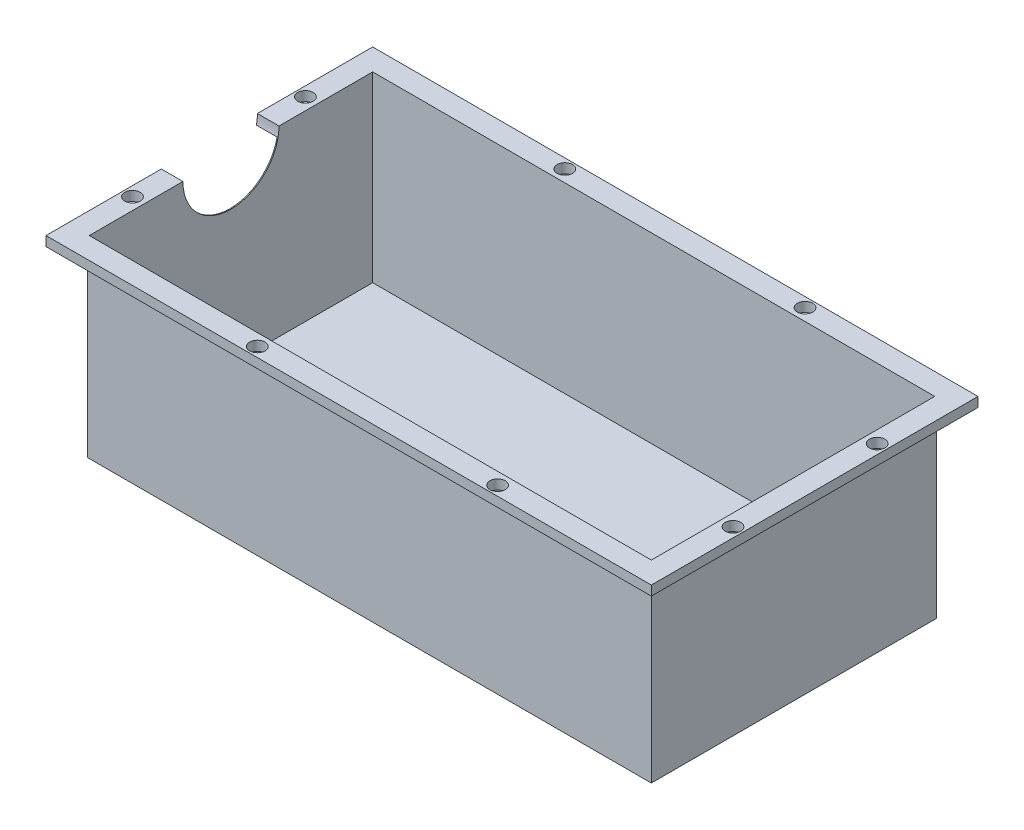
ISO-10303-21;
HEADER;
FILE_DESCRIPTION(('STEP AP214'),'2;1');
FILE_NAME('part.step','',(''),(''),'','','');
FILE_SCHEMA(('AUTOMOTIVE_DESIGN { 1 0 10303 214 1 1 1 1 }'));
ENDSEC;
DATA;
#1=APPLICATION_CONTEXT('core data for automotive mechanical design processes');
#2=APPLICATION_PROTOCOL_DEFINITION('international standard','automotive_design',2000,#1);
#3=PRODUCT_CONTEXT('',#1,'mechanical');
#4=PRODUCT('Part','Part','',(#3));
#5=PRODUCT_RELATED_PRODUCT_CATEGORY('part','',(#4));
#6=PRODUCT_DEFINITION_FORMATION('','',#4);
#7=PRODUCT_DEFINITION_CONTEXT('part definition',#1,'design');
#8=PRODUCT_DEFINITION('design','',#6,#7);
#9=PRODUCT_DEFINITION_SHAPE('','',#8);
#10=(LENGTH_UNIT() NAMED_UNIT(*) SI_UNIT(.MILLI.,.METRE.));
#11=(NAMED_UNIT(*) PLANE_ANGLE_UNIT() SI_UNIT($,.RADIAN.));
#12=(NAMED_UNIT(*) SI_UNIT($,.STERADIAN.) SOLID_ANGLE_UNIT());
#13=UNCERTAINTY_MEASURE_WITH_UNIT(LENGTH_MEASURE(1.E-05),#10,'distance_accuracy_value','');
#14=(GEOMETRIC_REPRESENTATION_CONTEXT(3) GLOBAL_UNCERTAINTY_ASSIGNED_CONTEXT((#13)) GLOBAL_UNIT_ASSIGNED_CONTEXT((#10,
#11,#12)) REPRESENTATION_CONTEXT('',''));
#15=CARTESIAN_POINT('',(0.,0.,0.));
#16=DIRECTION('',(0.,0.,1.));
#17=DIRECTION('',(1.,0.,0.));
#18=AXIS2_PLACEMENT_3D('',#15,#16,#17);
#19=CARTESIAN_POINT('',(-63.,40.,-34.));
#20=DIRECTION('',(1.,0.,0.));
#21=DIRECTION('',(0.,0.,-1.));
#22=AXIS2_PLACEMENT_3D('',#19,#20,#21);
#23=PLANE('',#22);
#24=DIRECTION('',(0.,0.,1.));
#25=VECTOR('',#24,1.);
#26=CARTESIAN_POINT('',(-63.,40.,-34.));
#27=LINE('',#26,#25);
#28=CARTESIAN_POINT('',(-63.,40.,10.));
#29=VERTEX_POINT('',#28);
#30=CARTESIAN_POINT('',(-63.,40.,34.));
#31=VERTEX_POINT('',#30);
#32=EDGE_CURVE('E194',#29,#31,#27,.T.);
#33=ORIENTED_EDGE('',*,*,#32,.F.);
#34=CARTESIAN_POINT('',(-63.,40.,0.));
#35=DIRECTION('',(-1.,0.,0.));
#36=DIRECTION('',(0.,0.,1.));
#37=AXIS2_PLACEMENT_3D('',#34,#35,#36);
#38=CIRCLE('',#37,10.);
#39=CARTESIAN_POINT('',(-63.,38.,9.79795897113272));
#40=VERTEX_POINT('',#39);
#41=EDGE_CURVE('E177',#40,#29,#38,.T.);
#42=ORIENTED_EDGE('',*,*,#41,.F.);
#43=DIRECTION('',(0.,0.,1.));
#44=VECTOR('',#43,1.);
#45=CARTESIAN_POINT('',(-63.,38.,-34.));
#46=LINE('',#45,#44);
#47=CARTESIAN_POINT('',(-63.,38.,34.));
#48=VERTEX_POINT('',#47);
#49=EDGE_CURVE('E306',#40,#48,#46,.T.);
#50=ORIENTED_EDGE('',*,*,#49,.T.);
#51=DIRECTION('',(0.,-1.,0.));
#52=VECTOR('',#51,1.);
#53=CARTESIAN_POINT('',(-63.,40.,34.));
#54=LINE('',#53,#52);
#55=EDGE_CURVE('E203',#31,#48,#54,.T.);
#56=ORIENTED_EDGE('',*,*,#55,.F.);
#57=EDGE_LOOP('',(#33,#42,#50,#56));
#58=FACE_BOUND('',#57,.T.);
#59=ADVANCED_FACE('F63',(#58),#23,.F.);
#60=CARTESIAN_POINT('',(63.,40.,-34.));
#61=DIRECTION('',(-1.,0.,0.));
#62=DIRECTION('',(0.,0.,1.));
#63=AXIS2_PLACEMENT_3D('',#60,#61,#62);
#64=PLANE('',#63);
#65=DIRECTION('',(0.,-1.,0.));
#66=VECTOR('',#65,1.);
#67=CARTESIAN_POINT('',(63.,40.,34.));
#68=LINE('',#67,#66);
#69=CARTESIAN_POINT('',(63.,40.,34.));
#70=VERTEX_POINT('',#69);
#71=CARTESIAN_POINT('',(63.,38.,34.));
#72=VERTEX_POINT('',#71);
#73=EDGE_CURVE('E219',#70,#72,#68,.T.);
#74=ORIENTED_EDGE('',*,*,#73,.T.);
#75=DIRECTION('',(0.,0.,1.));
#76=VECTOR('',#75,1.);
#77=CARTESIAN_POINT('',(63.,38.,-34.));
#78=LINE('',#77,#76);
#79=CARTESIAN_POINT('',(63.,38.,-34.));
#80=VERTEX_POINT('',#79);
#81=EDGE_CURVE('E88',#80,#72,#78,.T.);
#82=ORIENTED_EDGE('',*,*,#81,.F.);
#83=DIRECTION('',(0.,-1.,0.));
#84=VECTOR('',#83,1.);
#85=CARTESIAN_POINT('',(63.,40.,-34.));
#86=LINE('',#85,#84);
#87=CARTESIAN_POINT('',(63.,40.,-34.));
#88=VERTEX_POINT('',#87);
#89=EDGE_CURVE('E73',#88,#80,#86,.T.);
#90=ORIENTED_EDGE('',*,*,#89,.F.);
#91=DIRECTION('',(0.,0.,-1.));
#92=VECTOR('',#91,1.);
#93=CARTESIAN_POINT('',(63.,40.,-34.));
#94=LINE('',#93,#92);
#95=EDGE_CURVE('E213',#70,#88,#94,.T.);
#96=ORIENTED_EDGE('',*,*,#95,.F.);
#97=EDGE_LOOP('',(#74,#82,#90,#96));
#98=FACE_BOUND('',#97,.T.);
#99=ADVANCED_FACE('F65',(#98),#64,.F.);
#100=CARTESIAN_POINT('',(-63.,40.,-34.));
#101=DIRECTION('',(0.,0.,1.));
#102=DIRECTION('',(1.,0.,0.));
#103=AXIS2_PLACEMENT_3D('',#100,#101,#102);
#104=PLANE('',#103);
#105=ORIENTED_EDGE('',*,*,#89,.T.);
#106=DIRECTION('',(-1.,0.,0.));
#107=VECTOR('',#106,1.);
#108=CARTESIAN_POINT('',(63.,38.,-34.));
#109=LINE('',#108,#107);
#110=CARTESIAN_POINT('',(-63.,38.,-34.));
#111=VERTEX_POINT('',#110);
#112=EDGE_CURVE('E305',#80,#111,#109,.T.);
#113=ORIENTED_EDGE('',*,*,#112,.T.);
#114=DIRECTION('',(0.,-1.,0.));
#115=VECTOR('',#114,1.);
#116=CARTESIAN_POINT('',(-63.,40.,-34.));
#117=LINE('',#116,#115);
#118=CARTESIAN_POINT('',(-63.,40.,-34.));
#119=VERTEX_POINT('',#118);
#120=EDGE_CURVE('E225',#119,#111,#117,.T.);
#121=ORIENTED_EDGE('',*,*,#120,.F.);
#122=DIRECTION('',(-1.,0.,0.));
#123=VECTOR('',#122,1.);
#124=CARTESIAN_POINT('',(-63.,40.,-34.));
#125=LINE('',#124,#123);
#126=EDGE_CURVE('E207',#88,#119,#125,.T.);
#127=ORIENTED_EDGE('',*,*,#126,.F.);
#128=EDGE_LOOP('',(#105,#113,#121,#127));
#129=FACE_BOUND('',#128,.T.);
#130=ADVANCED_FACE('F286',(#129),#104,.F.);
#131=CARTESIAN_POINT('',(-63.,38.,-9.79795897113272));
#132=VERTEX_POINT('',#131);
#133=EDGE_CURVE('E300',#111,#132,#46,.T.);
#134=ORIENTED_EDGE('',*,*,#133,.T.);
#135=CARTESIAN_POINT('',(-63.,40.,-10.));
#136=VERTEX_POINT('',#135);
#137=EDGE_CURVE('E188',#136,#132,#38,.T.);
#138=ORIENTED_EDGE('',*,*,#137,.F.);
#139=EDGE_CURVE('E206',#119,#136,#27,.T.);
#140=ORIENTED_EDGE('',*,*,#139,.F.);
#141=ORIENTED_EDGE('',*,*,#120,.T.);
#142=EDGE_LOOP('',(#134,#138,#140,#141));
#143=FACE_BOUND('',#142,.T.);
#144=ADVANCED_FACE('F282',(#143),#23,.F.);
#145=CARTESIAN_POINT('',(-63.,40.,34.));
#146=DIRECTION('',(0.,0.,-1.));
#147=DIRECTION('',(-1.,0.,0.));
#148=AXIS2_PLACEMENT_3D('',#145,#146,#147);
#149=PLANE('',#148);
#150=ORIENTED_EDGE('',*,*,#55,.T.);
#151=DIRECTION('',(-1.,0.,0.));
#152=VECTOR('',#151,1.);
#153=CARTESIAN_POINT('',(63.,38.,34.));
#154=LINE('',#153,#152);
#155=EDGE_CURVE('E311',#72,#48,#154,.T.);
#156=ORIENTED_EDGE('',*,*,#155,.F.);
#157=ORIENTED_EDGE('',*,*,#73,.F.);
#158=DIRECTION('',(1.,0.,0.));
#159=VECTOR('',#158,1.);
#160=CARTESIAN_POINT('',(-63.,40.,34.));
#161=LINE('',#160,#159);
#162=EDGE_CURVE('E212',#31,#70,#161,.T.);
#163=ORIENTED_EDGE('',*,*,#162,.F.);
#164=EDGE_LOOP('',(#150,#156,#157,#163));
#165=FACE_BOUND('',#164,.T.);
#166=ADVANCED_FACE('F290',(#165),#149,.F.);
#167=CARTESIAN_POINT('',(0.,40.,0.));
#168=DIRECTION('',(0.,1.,0.));
#169=DIRECTION('',(0.,0.,1.));
#170=AXIS2_PLACEMENT_3D('',#167,#168,#169);
#171=PLANE('',#170);
#172=CARTESIAN_POINT('',(-61.,40.,18.));
#173=DIRECTION('',(0.,-1.,0.));
#174=DIRECTION('',(0.,0.,-1.));
#175=AXIS2_PLACEMENT_3D('',#172,#173,#174);
#176=CIRCLE('',#175,1.6);
#177=CARTESIAN_POINT('',(-61.,40.,16.4));
#178=VERTEX_POINT('',#177);
#179=EDGE_CURVE('E488',#178,#178,#176,.T.);
#180=ORIENTED_EDGE('',*,*,#179,.T.);
#181=EDGE_LOOP('',(#180));
#182=FACE_BOUND('',#181,.T.);
#183=CARTESIAN_POINT('',(-61.,40.,-18.));
#184=DIRECTION('',(0.,-1.,0.));
#185=DIRECTION('',(0.,0.,1.));
#186=AXIS2_PLACEMENT_3D('',#183,#184,#185);
#187=CIRCLE('',#186,1.6);
#188=CARTESIAN_POINT('',(-61.,40.,-16.4));
#189=VERTEX_POINT('',#188);
#190=EDGE_CURVE('E498',#189,#189,#187,.T.);
#191=ORIENTED_EDGE('',*,*,#190,.T.);
#192=EDGE_LOOP('',(#191));
#193=FACE_BOUND('',#192,.T.);
#194=CARTESIAN_POINT('',(61.,40.,-15.));
#195=DIRECTION('',(0.,-1.,0.));
#196=DIRECTION('',(0.,0.,1.));
#197=AXIS2_PLACEMENT_3D('',#194,#195,#196);
#198=CIRCLE('',#197,1.60000000000001);
#199=CARTESIAN_POINT('',(61.,40.,-13.4));
#200=VERTEX_POINT('',#199);
#201=EDGE_CURVE('E493',#200,#200,#198,.T.);
#202=ORIENTED_EDGE('',*,*,#201,.T.);
#203=EDGE_LOOP('',(#202));
#204=FACE_BOUND('',#203,.T.);
#205=CARTESIAN_POINT('',(-21.,40.,32.));
#206=DIRECTION('',(0.,-1.,0.));
#207=DIRECTION('',(0.,0.,-1.));
#208=AXIS2_PLACEMENT_3D('',#205,#206,#207);
#209=CIRCLE('',#208,1.6);
#210=CARTESIAN_POINT('',(-21.,40.,30.4));
#211=VERTEX_POINT('',#210);
#212=EDGE_CURVE('E489',#211,#211,#209,.T.);
#213=ORIENTED_EDGE('',*,*,#212,.T.);
#214=EDGE_LOOP('',(#213));
#215=FACE_BOUND('',#214,.T.);
#216=CARTESIAN_POINT('',(29.,40.,-32.));
#217=DIRECTION('',(0.,-1.,0.));
#218=DIRECTION('',(0.,0.,1.));
#219=AXIS2_PLACEMENT_3D('',#216,#217,#218);
#220=CIRCLE('',#219,1.6);
#221=CARTESIAN_POINT('',(29.,40.,-30.4));
#222=VERTEX_POINT('',#221);
#223=EDGE_CURVE('E509',#222,#222,#220,.T.);
#224=ORIENTED_EDGE('',*,*,#223,.T.);
#225=EDGE_LOOP('',(#224));
#226=FACE_BOUND('',#225,.T.);
#227=CARTESIAN_POINT('',(-21.,40.,-32.));
#228=DIRECTION('',(0.,-1.,0.));
#229=DIRECTION('',(0.,0.,1.));
#230=AXIS2_PLACEMENT_3D('',#227,#228,#229);
#231=CIRCLE('',#230,1.6);
#232=CARTESIAN_POINT('',(-21.,40.,-30.4));
#233=VERTEX_POINT('',#232);
#234=EDGE_CURVE('E505',#233,#233,#231,.T.);
#235=ORIENTED_EDGE('',*,*,#234,.T.);
#236=EDGE_LOOP('',(#235));
#237=FACE_BOUND('',#236,.T.);
#238=CARTESIAN_POINT('',(29.,40.,32.));
#239=DIRECTION('',(0.,-1.,0.));
#240=DIRECTION('',(0.,0.,-1.));
#241=AXIS2_PLACEMENT_3D('',#238,#239,#240);
#242=CIRCLE('',#241,1.6);
#243=CARTESIAN_POINT('',(29.,40.,30.4));
#244=VERTEX_POINT('',#243);
#245=EDGE_CURVE('E494',#244,#244,#242,.T.);
#246=ORIENTED_EDGE('',*,*,#245,.T.);
#247=EDGE_LOOP('',(#246));
#248=FACE_BOUND('',#247,.T.);
#249=CARTESIAN_POINT('',(61.,40.,15.));
#250=DIRECTION('',(0.,-1.,0.));
#251=DIRECTION('',(0.,0.,-1.));
#252=AXIS2_PLACEMENT_3D('',#249,#250,#251);
#253=CIRCLE('',#252,1.6);
#254=CARTESIAN_POINT('',(61.,40.,13.4));
#255=VERTEX_POINT('',#254);
#256=EDGE_CURVE('E237',#255,#255,#253,.T.);
#257=ORIENTED_EDGE('',*,*,#256,.T.);
#258=EDGE_LOOP('',(#257));
#259=FACE_BOUND('',#258,.T.);
#260=DIRECTION('',(-1.,0.,0.));
#261=VECTOR('',#260,1.);
#262=CARTESIAN_POINT('',(-25.,40.,-10.));
#263=LINE('',#262,#261);
#264=CARTESIAN_POINT('',(-58.5,40.,-10.));
#265=VERTEX_POINT('',#264);
#266=EDGE_CURVE('E199',#265,#136,#263,.T.);
#267=ORIENTED_EDGE('',*,*,#266,.F.);
#268=DIRECTION('',(0.,0.,1.));
#269=VECTOR('',#268,1.);
#270=CARTESIAN_POINT('',(-58.5,40.,-29.5));
#271=LINE('',#270,#269);
#272=CARTESIAN_POINT('',(-58.5,40.,-29.5));
#273=VERTEX_POINT('',#272);
#274=EDGE_CURVE('E323',#273,#265,#271,.T.);
#275=ORIENTED_EDGE('',*,*,#274,.F.);
#276=DIRECTION('',(-1.,0.,0.));
#277=VECTOR('',#276,1.);
#278=CARTESIAN_POINT('',(58.5,40.,-29.5));
#279=LINE('',#278,#277);
#280=CARTESIAN_POINT('',(58.5,40.,-29.5));
#281=VERTEX_POINT('',#280);
#282=EDGE_CURVE('E342',#281,#273,#279,.T.);
#283=ORIENTED_EDGE('',*,*,#282,.F.);
#284=DIRECTION('',(0.,0.,-1.));
#285=VECTOR('',#284,1.);
#286=CARTESIAN_POINT('',(58.5,40.,29.5));
#287=LINE('',#286,#285);
#288=CARTESIAN_POINT('',(58.5,40.,29.5));
#289=VERTEX_POINT('',#288);
#290=EDGE_CURVE('E338',#289,#281,#287,.T.);
#291=ORIENTED_EDGE('',*,*,#290,.F.);
#292=DIRECTION('',(1.,0.,0.));
#293=VECTOR('',#292,1.);
#294=CARTESIAN_POINT('',(-58.5,40.,29.5));
#295=LINE('',#294,#293);
#296=CARTESIAN_POINT('',(-58.5,40.,29.5));
#297=VERTEX_POINT('',#296);
#298=EDGE_CURVE('E317',#297,#289,#295,.T.);
#299=ORIENTED_EDGE('',*,*,#298,.F.);
#300=CARTESIAN_POINT('',(-58.5,40.,10.));
#301=VERTEX_POINT('',#300);
#302=EDGE_CURVE('E197',#301,#297,#271,.T.);
#303=ORIENTED_EDGE('',*,*,#302,.F.);
#304=DIRECTION('',(-1.,0.,0.));
#305=VECTOR('',#304,1.);
#306=CARTESIAN_POINT('',(-25.,40.,10.));
#307=LINE('',#306,#305);
#308=EDGE_CURVE('E180',#29,#301,#307,.F.);
#309=ORIENTED_EDGE('',*,*,#308,.F.);
#310=ORIENTED_EDGE('',*,*,#32,.T.);
#311=ORIENTED_EDGE('',*,*,#162,.T.);
#312=ORIENTED_EDGE('',*,*,#95,.T.);
#313=ORIENTED_EDGE('',*,*,#126,.T.);
#314=ORIENTED_EDGE('',*,*,#139,.T.);
#315=EDGE_LOOP('',(#267,#275,#283,#291,#299,#303,#309,#310,#311,#312,#313,#314));
#316=FACE_BOUND('',#315,.T.);
#317=ADVANCED_FACE('F193',(#182,#193,#204,#215,#226,#237,#248,#259,#316),#171,.T.);
#318=CARTESIAN_POINT('',(-58.5,2.,29.5));
#319=DIRECTION('',(0.,0.,1.));
#320=DIRECTION('',(1.,0.,0.));
#321=AXIS2_PLACEMENT_3D('',#318,#319,#320);
#322=PLANE('',#321);
#323=ORIENTED_EDGE('',*,*,#298,.T.);
#324=DIRECTION('',(0.,1.,0.));
#325=VECTOR('',#324,1.);
#326=CARTESIAN_POINT('',(58.5,2.,29.5));
#327=LINE('',#326,#325);
#328=CARTESIAN_POINT('',(58.5,2.,29.5));
#329=VERTEX_POINT('',#328);
#330=EDGE_CURVE('E335',#329,#289,#327,.T.);
#331=ORIENTED_EDGE('',*,*,#330,.F.);
#332=DIRECTION('',(1.,0.,0.));
#333=VECTOR('',#332,1.);
#334=CARTESIAN_POINT('',(-58.5,2.,29.5));
#335=LINE('',#334,#333);
#336=CARTESIAN_POINT('',(-58.5,2.,29.5));
#337=VERTEX_POINT('',#336);
#338=EDGE_CURVE('E318',#337,#329,#335,.T.);
#339=ORIENTED_EDGE('',*,*,#338,.F.);
#340=DIRECTION('',(0.,1.,0.));
#341=VECTOR('',#340,1.);
#342=CARTESIAN_POINT('',(-58.5,2.,29.5));
#343=LINE('',#342,#341);
#344=EDGE_CURVE('E349',#337,#297,#343,.T.);
#345=ORIENTED_EDGE('',*,*,#344,.T.);
#346=EDGE_LOOP('',(#323,#331,#339,#345));
#347=FACE_BOUND('',#346,.T.);
#348=ADVANCED_FACE('F383',(#347),#322,.F.);
#349=CARTESIAN_POINT('',(-58.5,2.,-29.5));
#350=DIRECTION('',(-1.,0.,0.));
#351=DIRECTION('',(0.,0.,1.));
#352=AXIS2_PLACEMENT_3D('',#349,#350,#351);
#353=PLANE('',#352);
#354=ORIENTED_EDGE('',*,*,#274,.T.);
#355=CARTESIAN_POINT('',(-58.5,40.,0.));
#356=DIRECTION('',(-1.,0.,0.));
#357=DIRECTION('',(0.,0.,1.));
#358=AXIS2_PLACEMENT_3D('',#355,#356,#357);
#359=CIRCLE('',#358,10.);
#360=EDGE_CURVE('E200',#265,#301,#359,.T.);
#361=ORIENTED_EDGE('',*,*,#360,.T.);
#362=ORIENTED_EDGE('',*,*,#302,.T.);
#363=ORIENTED_EDGE('',*,*,#344,.F.);
#364=DIRECTION('',(0.,0.,1.));
#365=VECTOR('',#364,1.);
#366=CARTESIAN_POINT('',(-58.5,2.,-29.5));
#367=LINE('',#366,#365);
#368=CARTESIAN_POINT('',(-58.5,2.,-29.5));
#369=VERTEX_POINT('',#368);
#370=EDGE_CURVE('E331',#369,#337,#367,.T.);
#371=ORIENTED_EDGE('',*,*,#370,.F.);
#372=DIRECTION('',(0.,1.,0.));
#373=VECTOR('',#372,1.);
#374=CARTESIAN_POINT('',(-58.5,2.,-29.5));
#375=LINE('',#374,#373);
#376=EDGE_CURVE('E353',#369,#273,#375,.T.);
#377=ORIENTED_EDGE('',*,*,#376,.T.);
#378=EDGE_LOOP('',(#354,#361,#362,#363,#371,#377));
#379=FACE_BOUND('',#378,.T.);
#380=ADVANCED_FACE('F372',(#379),#353,.F.);
#381=CARTESIAN_POINT('',(58.5,2.,-29.5));
#382=DIRECTION('',(0.,0.,-1.));
#383=DIRECTION('',(-1.,0.,0.));
#384=AXIS2_PLACEMENT_3D('',#381,#382,#383);
#385=PLANE('',#384);
#386=ORIENTED_EDGE('',*,*,#282,.T.);
#387=ORIENTED_EDGE('',*,*,#376,.F.);
#388=DIRECTION('',(-1.,0.,0.));
#389=VECTOR('',#388,1.);
#390=CARTESIAN_POINT('',(58.5,2.,-29.5));
#391=LINE('',#390,#389);
#392=CARTESIAN_POINT('',(58.5,2.,-29.5));
#393=VERTEX_POINT('',#392);
#394=EDGE_CURVE('E327',#393,#369,#391,.T.);
#395=ORIENTED_EDGE('',*,*,#394,.F.);
#396=DIRECTION('',(0.,1.,0.));
#397=VECTOR('',#396,1.);
#398=CARTESIAN_POINT('',(58.5,2.,-29.5));
#399=LINE('',#398,#397);
#400=EDGE_CURVE('E356',#393,#281,#399,.T.);
#401=ORIENTED_EDGE('',*,*,#400,.T.);
#402=EDGE_LOOP('',(#386,#387,#395,#401));
#403=FACE_BOUND('',#402,.T.);
#404=ADVANCED_FACE('F376',(#403),#385,.F.);
#405=CARTESIAN_POINT('',(58.5,2.,29.5));
#406=DIRECTION('',(1.,0.,0.));
#407=DIRECTION('',(0.,0.,-1.));
#408=AXIS2_PLACEMENT_3D('',#405,#406,#407);
#409=PLANE('',#408);
#410=ORIENTED_EDGE('',*,*,#290,.T.);
#411=ORIENTED_EDGE('',*,*,#400,.F.);
#412=DIRECTION('',(0.,0.,-1.));
#413=VECTOR('',#412,1.);
#414=CARTESIAN_POINT('',(58.5,2.,29.5));
#415=LINE('',#414,#413);
#416=EDGE_CURVE('E322',#329,#393,#415,.T.);
#417=ORIENTED_EDGE('',*,*,#416,.F.);
#418=ORIENTED_EDGE('',*,*,#330,.T.);
#419=EDGE_LOOP('',(#410,#411,#417,#418));
#420=FACE_BOUND('',#419,.T.);
#421=ADVANCED_FACE('F379',(#420),#409,.F.);
#422=CARTESIAN_POINT('',(0.,2.,0.));
#423=DIRECTION('',(0.,1.,0.));
#424=DIRECTION('',(0.,0.,1.));
#425=AXIS2_PLACEMENT_3D('',#422,#423,#424);
#426=PLANE('',#425);
#427=ORIENTED_EDGE('',*,*,#338,.T.);
#428=ORIENTED_EDGE('',*,*,#416,.T.);
#429=ORIENTED_EDGE('',*,*,#394,.T.);
#430=ORIENTED_EDGE('',*,*,#370,.T.);
#431=EDGE_LOOP('',(#427,#428,#429,#430));
#432=FACE_BOUND('',#431,.T.);
#433=ADVANCED_FACE('F386',(#432),#426,.T.);
#434=CARTESIAN_POINT('',(0.,38.,0.));
#435=DIRECTION('',(0.,1.,0.));
#436=DIRECTION('',(0.,0.,1.));
#437=AXIS2_PLACEMENT_3D('',#434,#435,#436);
#438=PLANE('',#437);
#439=CARTESIAN_POINT('',(-61.,38.,18.));
#440=DIRECTION('',(0.,1.,0.));
#441=DIRECTION('',(0.,0.,1.));
#442=AXIS2_PLACEMENT_3D('',#439,#440,#441);
#443=CIRCLE('',#442,1.6);
#444=CARTESIAN_POINT('',(-61.,38.,19.6));
#445=VERTEX_POINT('',#444);
#446=EDGE_CURVE('E67',#445,#445,#443,.T.);
#447=ORIENTED_EDGE('',*,*,#446,.T.);
#448=EDGE_LOOP('',(#447));
#449=FACE_BOUND('',#448,.T.);
#450=CARTESIAN_POINT('',(-61.,38.,-18.));
#451=DIRECTION('',(0.,1.,0.));
#452=DIRECTION('',(0.,0.,1.));
#453=AXIS2_PLACEMENT_3D('',#450,#451,#452);
#454=CIRCLE('',#453,1.6);
#455=CARTESIAN_POINT('',(-61.,38.,-16.4));
#456=VERTEX_POINT('',#455);
#457=EDGE_CURVE('E256',#456,#456,#454,.T.);
#458=ORIENTED_EDGE('',*,*,#457,.T.);
#459=EDGE_LOOP('',(#458));
#460=FACE_BOUND('',#459,.T.);
#461=CARTESIAN_POINT('',(61.,38.,-15.));
#462=DIRECTION('',(0.,1.,0.));
#463=DIRECTION('',(0.,0.,1.));
#464=AXIS2_PLACEMENT_3D('',#461,#462,#463);
#465=CIRCLE('',#464,1.60000000000001);
#466=CARTESIAN_POINT('',(61.,38.,-13.4));
#467=VERTEX_POINT('',#466);
#468=EDGE_CURVE('E253',#467,#467,#465,.T.);
#469=ORIENTED_EDGE('',*,*,#468,.T.);
#470=EDGE_LOOP('',(#469));
#471=FACE_BOUND('',#470,.T.);
#472=CARTESIAN_POINT('',(-21.,38.,32.));
#473=DIRECTION('',(0.,1.,0.));
#474=DIRECTION('',(0.,0.,1.));
#475=AXIS2_PLACEMENT_3D('',#472,#473,#474);
#476=CIRCLE('',#475,1.6);
#477=CARTESIAN_POINT('',(-21.,38.,33.6));
#478=VERTEX_POINT('',#477);
#479=EDGE_CURVE('E249',#478,#478,#476,.T.);
#480=ORIENTED_EDGE('',*,*,#479,.T.);
#481=EDGE_LOOP('',(#480));
#482=FACE_BOUND('',#481,.T.);
#483=CARTESIAN_POINT('',(29.,38.,-32.));
#484=DIRECTION('',(0.,1.,0.));
#485=DIRECTION('',(0.,0.,1.));
#486=AXIS2_PLACEMENT_3D('',#483,#484,#485);
#487=CIRCLE('',#486,1.6);
#488=CARTESIAN_POINT('',(29.,38.,-30.4));
#489=VERTEX_POINT('',#488);
#490=EDGE_CURVE('E245',#489,#489,#487,.T.);
#491=ORIENTED_EDGE('',*,*,#490,.T.);
#492=EDGE_LOOP('',(#491));
#493=FACE_BOUND('',#492,.T.);
#494=CARTESIAN_POINT('',(-21.,38.,-32.));
#495=DIRECTION('',(0.,1.,0.));
#496=DIRECTION('',(0.,0.,1.));
#497=AXIS2_PLACEMENT_3D('',#494,#495,#496);
#498=CIRCLE('',#497,1.6);
#499=CARTESIAN_POINT('',(-21.,38.,-30.4));
#500=VERTEX_POINT('',#499);
#501=EDGE_CURVE('E241',#500,#500,#498,.T.);
#502=ORIENTED_EDGE('',*,*,#501,.T.);
#503=EDGE_LOOP('',(#502));
#504=FACE_BOUND('',#503,.T.);
#505=CARTESIAN_POINT('',(29.,38.,32.));
#506=DIRECTION('',(0.,1.,0.));
#507=DIRECTION('',(0.,0.,1.));
#508=AXIS2_PLACEMENT_3D('',#505,#506,#507);
#509=CIRCLE('',#508,1.6);
#510=CARTESIAN_POINT('',(29.,38.,33.6));
#511=VERTEX_POINT('',#510);
#512=EDGE_CURVE('E236',#511,#511,#509,.T.);
#513=ORIENTED_EDGE('',*,*,#512,.T.);
#514=EDGE_LOOP('',(#513));
#515=FACE_BOUND('',#514,.T.);
#516=CARTESIAN_POINT('',(61.,38.,15.));
#517=DIRECTION('',(0.,1.,0.));
#518=DIRECTION('',(0.,0.,1.));
#519=AXIS2_PLACEMENT_3D('',#516,#517,#518);
#520=CIRCLE('',#519,1.6);
#521=CARTESIAN_POINT('',(61.,38.,16.6));
#522=VERTEX_POINT('',#521);
#523=EDGE_CURVE('E232',#522,#522,#520,.T.);
#524=ORIENTED_EDGE('',*,*,#523,.T.);
#525=EDGE_LOOP('',(#524));
#526=FACE_BOUND('',#525,.T.);
#527=DIRECTION('',(0.,0.,1.));
#528=VECTOR('',#527,1.);
#529=CARTESIAN_POINT('',(-58.7,38.,0.));
#530=LINE('',#529,#528);
#531=CARTESIAN_POINT('',(-58.7,38.,-29.7));
#532=VERTEX_POINT('',#531);
#533=CARTESIAN_POINT('',(-58.7,38.,-9.79795897113272));
#534=VERTEX_POINT('',#533);
#535=EDGE_CURVE('E452',#532,#534,#530,.T.);
#536=ORIENTED_EDGE('',*,*,#535,.T.);
#537=DIRECTION('',(-1.,0.,0.));
#538=VECTOR('',#537,1.);
#539=CARTESIAN_POINT('',(-25.,38.,-9.79795897113272));
#540=LINE('',#539,#538);
#541=EDGE_CURVE('E81',#534,#132,#540,.T.);
#542=ORIENTED_EDGE('',*,*,#541,.T.);
#543=ORIENTED_EDGE('',*,*,#133,.F.);
#544=ORIENTED_EDGE('',*,*,#112,.F.);
#545=ORIENTED_EDGE('',*,*,#81,.T.);
#546=ORIENTED_EDGE('',*,*,#155,.T.);
#547=ORIENTED_EDGE('',*,*,#49,.F.);
#548=DIRECTION('',(-1.,0.,0.));
#549=VECTOR('',#548,1.);
#550=CARTESIAN_POINT('',(-25.,38.,9.79795897113272));
#551=LINE('',#550,#549);
#552=CARTESIAN_POINT('',(-58.7,38.,9.79795897113272));
#553=VERTEX_POINT('',#552);
#554=EDGE_CURVE('E183',#40,#553,#551,.F.);
#555=ORIENTED_EDGE('',*,*,#554,.T.);
#556=CARTESIAN_POINT('',(-58.7,38.,29.7));
#557=VERTEX_POINT('',#556);
#558=EDGE_CURVE('E458',#553,#557,#530,.T.);
#559=ORIENTED_EDGE('',*,*,#558,.T.);
#560=DIRECTION('',(-1.,0.,0.));
#561=VECTOR('',#560,1.);
#562=CARTESIAN_POINT('',(0.,38.,29.7));
#563=LINE('',#562,#561);
#564=CARTESIAN_POINT('',(58.7,38.,29.7));
#565=VERTEX_POINT('',#564);
#566=EDGE_CURVE('E462',#565,#557,#563,.T.);
#567=ORIENTED_EDGE('',*,*,#566,.F.);
#568=DIRECTION('',(0.,0.,1.));
#569=VECTOR('',#568,1.);
#570=CARTESIAN_POINT('',(58.7,38.,0.));
#571=LINE('',#570,#569);
#572=CARTESIAN_POINT('',(58.7,38.,-29.7));
#573=VERTEX_POINT('',#572);
#574=EDGE_CURVE('E435',#573,#565,#571,.T.);
#575=ORIENTED_EDGE('',*,*,#574,.F.);
#576=DIRECTION('',(-1.,0.,0.));
#577=VECTOR('',#576,1.);
#578=CARTESIAN_POINT('',(0.,38.,-29.7));
#579=LINE('',#578,#577);
#580=EDGE_CURVE('E431',#573,#532,#579,.T.);
#581=ORIENTED_EDGE('',*,*,#580,.T.);
#582=EDGE_LOOP('',(#536,#542,#543,#544,#545,#546,#547,#555,#559,#567,#575,#581));
#583=FACE_BOUND('',#582,.T.);
#584=ADVANCED_FACE('F265',(#449,#460,#471,#482,#493,#504,#515,#526,#583),#438,.F.);
#585=CARTESIAN_POINT('',(0.,38.,-29.7));
#586=DIRECTION('',(0.,0.,1.));
#587=DIRECTION('',(1.,0.,0.));
#588=AXIS2_PLACEMENT_3D('',#585,#586,#587);
#589=PLANE('',#588);
#590=DIRECTION('',(-1.,0.,0.));
#591=VECTOR('',#590,1.);
#592=CARTESIAN_POINT('',(0.,0.,-29.7));
#593=LINE('',#592,#591);
#594=CARTESIAN_POINT('',(58.7,0.,-29.7));
#595=VERTEX_POINT('',#594);
#596=CARTESIAN_POINT('',(-58.7,0.,-29.7));
#597=VERTEX_POINT('',#596);
#598=EDGE_CURVE('E369',#595,#597,#593,.T.);
#599=ORIENTED_EDGE('',*,*,#598,.T.);
#600=DIRECTION('',(0.,-1.,0.));
#601=VECTOR('',#600,1.);
#602=CARTESIAN_POINT('',(-58.7,38.,-29.7));
#603=LINE('',#602,#601);
#604=EDGE_CURVE('E441',#532,#597,#603,.T.);
#605=ORIENTED_EDGE('',*,*,#604,.F.);
#606=ORIENTED_EDGE('',*,*,#580,.F.);
#607=DIRECTION('',(0.,-1.,0.));
#608=VECTOR('',#607,1.);
#609=CARTESIAN_POINT('',(58.7,38.,-29.7));
#610=LINE('',#609,#608);
#611=EDGE_CURVE('E450',#573,#595,#610,.T.);
#612=ORIENTED_EDGE('',*,*,#611,.T.);
#613=EDGE_LOOP('',(#599,#605,#606,#612));
#614=FACE_BOUND('',#613,.T.);
#615=ADVANCED_FACE('F393',(#614),#589,.F.);
#616=CARTESIAN_POINT('',(-58.7,38.,0.));
#617=DIRECTION('',(1.,0.,0.));
#618=DIRECTION('',(0.,0.,-1.));
#619=AXIS2_PLACEMENT_3D('',#616,#617,#618);
#620=PLANE('',#619);
#621=ORIENTED_EDGE('',*,*,#558,.F.);
#622=CARTESIAN_POINT('',(-58.7,40.,0.));
#623=DIRECTION('',(1.,0.,0.));
#624=DIRECTION('',(0.,0.,-1.));
#625=AXIS2_PLACEMENT_3D('',#622,#623,#624);
#626=CIRCLE('',#625,10.);
#627=EDGE_CURVE('E12',#553,#534,#626,.T.);
#628=ORIENTED_EDGE('',*,*,#627,.T.);
#629=ORIENTED_EDGE('',*,*,#535,.F.);
#630=ORIENTED_EDGE('',*,*,#604,.T.);
#631=DIRECTION('',(0.,0.,1.));
#632=VECTOR('',#631,1.);
#633=CARTESIAN_POINT('',(-58.7,0.,0.));
#634=LINE('',#633,#632);
#635=CARTESIAN_POINT('',(-58.7,0.,29.7));
#636=VERTEX_POINT('',#635);
#637=EDGE_CURVE('E424',#597,#636,#634,.T.);
#638=ORIENTED_EDGE('',*,*,#637,.T.);
#639=DIRECTION('',(0.,-1.,0.));
#640=VECTOR('',#639,1.);
#641=CARTESIAN_POINT('',(-58.7,38.,29.7));
#642=LINE('',#641,#640);
#643=EDGE_CURVE('E444',#557,#636,#642,.T.);
#644=ORIENTED_EDGE('',*,*,#643,.F.);
#645=EDGE_LOOP('',(#621,#628,#629,#630,#638,#644));
#646=FACE_BOUND('',#645,.T.);
#647=ADVANCED_FACE('F474',(#646),#620,.F.);
#648=CARTESIAN_POINT('',(0.,38.,29.7));
#649=DIRECTION('',(0.,0.,1.));
#650=DIRECTION('',(1.,0.,0.));
#651=AXIS2_PLACEMENT_3D('',#648,#649,#650);
#652=PLANE('',#651);
#653=DIRECTION('',(-1.,0.,0.));
#654=VECTOR('',#653,1.);
#655=CARTESIAN_POINT('',(0.,0.,29.7));
#656=LINE('',#655,#654);
#657=CARTESIAN_POINT('',(58.7,0.,29.7));
#658=VERTEX_POINT('',#657);
#659=EDGE_CURVE('E427',#658,#636,#656,.T.);
#660=ORIENTED_EDGE('',*,*,#659,.F.);
#661=DIRECTION('',(0.,-1.,0.));
#662=VECTOR('',#661,1.);
#663=CARTESIAN_POINT('',(58.7,38.,29.7));
#664=LINE('',#663,#662);
#665=EDGE_CURVE('E447',#565,#658,#664,.T.);
#666=ORIENTED_EDGE('',*,*,#665,.F.);
#667=ORIENTED_EDGE('',*,*,#566,.T.);
#668=ORIENTED_EDGE('',*,*,#643,.T.);
#669=EDGE_LOOP('',(#660,#666,#667,#668));
#670=FACE_BOUND('',#669,.T.);
#671=ADVANCED_FACE('F417',(#670),#652,.T.);
#672=CARTESIAN_POINT('',(58.7,38.,0.));
#673=DIRECTION('',(1.,0.,0.));
#674=DIRECTION('',(0.,0.,-1.));
#675=AXIS2_PLACEMENT_3D('',#672,#673,#674);
#676=PLANE('',#675);
#677=DIRECTION('',(0.,0.,1.));
#678=VECTOR('',#677,1.);
#679=CARTESIAN_POINT('',(58.7,0.,0.));
#680=LINE('',#679,#678);
#681=EDGE_CURVE('E437',#595,#658,#680,.T.);
#682=ORIENTED_EDGE('',*,*,#681,.F.);
#683=ORIENTED_EDGE('',*,*,#611,.F.);
#684=ORIENTED_EDGE('',*,*,#574,.T.);
#685=ORIENTED_EDGE('',*,*,#665,.T.);
#686=EDGE_LOOP('',(#682,#683,#684,#685));
#687=FACE_BOUND('',#686,.T.);
#688=ADVANCED_FACE('F409',(#687),#676,.T.);
#689=CARTESIAN_POINT('',(0.,0.,0.));
#690=DIRECTION('',(0.,1.,0.));
#691=DIRECTION('',(0.,0.,1.));
#692=AXIS2_PLACEMENT_3D('',#689,#690,#691);
#693=PLANE('',#692);
#694=ORIENTED_EDGE('',*,*,#637,.F.);
#695=ORIENTED_EDGE('',*,*,#598,.F.);
#696=ORIENTED_EDGE('',*,*,#681,.T.);
#697=ORIENTED_EDGE('',*,*,#659,.T.);
#698=EDGE_LOOP('',(#694,#695,#696,#697));
#699=FACE_BOUND('',#698,.T.);
#700=ADVANCED_FACE('F407',(#699),#693,.F.);
#701=CARTESIAN_POINT('',(-25.,40.,0.));
#702=DIRECTION('',(-1.,0.,0.));
#703=DIRECTION('',(0.,0.,1.));
#704=AXIS2_PLACEMENT_3D('',#701,#702,#703);
#705=CYLINDRICAL_SURFACE('',#704,10.);
#706=ORIENTED_EDGE('',*,*,#266,.T.);
#707=ORIENTED_EDGE('',*,*,#137,.T.);
#708=ORIENTED_EDGE('',*,*,#541,.F.);
#709=ORIENTED_EDGE('',*,*,#627,.F.);
#710=ORIENTED_EDGE('',*,*,#554,.F.);
#711=ORIENTED_EDGE('',*,*,#41,.T.);
#712=ORIENTED_EDGE('',*,*,#308,.T.);
#713=ORIENTED_EDGE('',*,*,#360,.F.);
#714=EDGE_LOOP('',(#706,#707,#708,#709,#710,#711,#712,#713));
#715=FACE_BOUND('',#714,.T.);
#716=ADVANCED_FACE('F179',(#715),#705,.F.);
#717=CARTESIAN_POINT('',(61.,40.,15.));
#718=DIRECTION('',(0.,-1.,0.));
#719=DIRECTION('',(0.,0.,-1.));
#720=AXIS2_PLACEMENT_3D('',#717,#718,#719);
#721=CYLINDRICAL_SURFACE('',#720,1.6);
#722=ORIENTED_EDGE('',*,*,#256,.F.);
#723=EDGE_LOOP('',(#722));
#724=FACE_BOUND('',#723,.T.);
#725=ORIENTED_EDGE('',*,*,#523,.F.);
#726=EDGE_LOOP('',(#725));
#727=FACE_BOUND('',#726,.T.);
#728=ADVANCED_FACE('F415',(#724,#727),#721,.F.);
#729=CARTESIAN_POINT('',(29.,40.,32.));
#730=DIRECTION('',(0.,-1.,0.));
#731=DIRECTION('',(0.,0.,-1.));
#732=AXIS2_PLACEMENT_3D('',#729,#730,#731);
#733=CYLINDRICAL_SURFACE('',#732,1.6);
#734=ORIENTED_EDGE('',*,*,#245,.F.);
#735=EDGE_LOOP('',(#734));
#736=FACE_BOUND('',#735,.T.);
#737=ORIENTED_EDGE('',*,*,#512,.F.);
#738=EDGE_LOOP('',(#737));
#739=FACE_BOUND('',#738,.T.);
#740=ADVANCED_FACE('F535',(#736,#739),#733,.F.);
#741=CARTESIAN_POINT('',(-21.,40.,-32.));
#742=DIRECTION('',(0.,-1.,0.));
#743=DIRECTION('',(0.,0.,-1.));
#744=AXIS2_PLACEMENT_3D('',#741,#742,#743);
#745=CYLINDRICAL_SURFACE('',#744,1.6);
#746=ORIENTED_EDGE('',*,*,#234,.F.);
#747=EDGE_LOOP('',(#746));
#748=FACE_BOUND('',#747,.T.);
#749=ORIENTED_EDGE('',*,*,#501,.F.);
#750=EDGE_LOOP('',(#749));
#751=FACE_BOUND('',#750,.T.);
#752=ADVANCED_FACE('F523',(#748,#751),#745,.F.);
#753=CARTESIAN_POINT('',(29.,40.,-32.));
#754=DIRECTION('',(0.,-1.,0.));
#755=DIRECTION('',(0.,0.,-1.));
#756=AXIS2_PLACEMENT_3D('',#753,#754,#755);
#757=CYLINDRICAL_SURFACE('',#756,1.6);
#758=ORIENTED_EDGE('',*,*,#223,.F.);
#759=EDGE_LOOP('',(#758));
#760=FACE_BOUND('',#759,.T.);
#761=ORIENTED_EDGE('',*,*,#490,.F.);
#762=EDGE_LOOP('',(#761));
#763=FACE_BOUND('',#762,.T.);
#764=ADVANCED_FACE('F519',(#760,#763),#757,.F.);
#765=CARTESIAN_POINT('',(-21.,40.,32.));
#766=DIRECTION('',(0.,-1.,0.));
#767=DIRECTION('',(0.,0.,-1.));
#768=AXIS2_PLACEMENT_3D('',#765,#766,#767);
#769=CYLINDRICAL_SURFACE('',#768,1.6);
#770=ORIENTED_EDGE('',*,*,#212,.F.);
#771=EDGE_LOOP('',(#770));
#772=FACE_BOUND('',#771,.T.);
#773=ORIENTED_EDGE('',*,*,#479,.F.);
#774=EDGE_LOOP('',(#773));
#775=FACE_BOUND('',#774,.T.);
#776=ADVANCED_FACE('F522',(#772,#775),#769,.F.);
#777=CARTESIAN_POINT('',(61.,40.,-15.));
#778=DIRECTION('',(0.,-1.,0.));
#779=DIRECTION('',(0.,0.,-1.));
#780=AXIS2_PLACEMENT_3D('',#777,#778,#779);
#781=CYLINDRICAL_SURFACE('',#780,1.60000000000001);
#782=ORIENTED_EDGE('',*,*,#201,.F.);
#783=EDGE_LOOP('',(#782));
#784=FACE_BOUND('',#783,.T.);
#785=ORIENTED_EDGE('',*,*,#468,.F.);
#786=EDGE_LOOP('',(#785));
#787=FACE_BOUND('',#786,.T.);
#788=ADVANCED_FACE('F275',(#784,#787),#781,.F.);
#789=CARTESIAN_POINT('',(-61.,40.,-18.));
#790=DIRECTION('',(0.,-1.,0.));
#791=DIRECTION('',(0.,0.,-1.));
#792=AXIS2_PLACEMENT_3D('',#789,#790,#791);
#793=CYLINDRICAL_SURFACE('',#792,1.6);
#794=ORIENTED_EDGE('',*,*,#190,.F.);
#795=EDGE_LOOP('',(#794));
#796=FACE_BOUND('',#795,.T.);
#797=ORIENTED_EDGE('',*,*,#457,.F.);
#798=EDGE_LOOP('',(#797));
#799=FACE_BOUND('',#798,.T.);
#800=ADVANCED_FACE('F269',(#796,#799),#793,.F.);
#801=CARTESIAN_POINT('',(-61.,40.,18.));
#802=DIRECTION('',(0.,-1.,0.));
#803=DIRECTION('',(0.,0.,-1.));
#804=AXIS2_PLACEMENT_3D('',#801,#802,#803);
#805=CYLINDRICAL_SURFACE('',#804,1.6);
#806=ORIENTED_EDGE('',*,*,#179,.F.);
#807=EDGE_LOOP('',(#806));
#808=FACE_BOUND('',#807,.T.);
#809=ORIENTED_EDGE('',*,*,#446,.F.);
#810=EDGE_LOOP('',(#809));
#811=FACE_BOUND('',#810,.T.);
#812=ADVANCED_FACE('F267',(#808,#811),#805,.F.);
#813=CLOSED_SHELL('',(#59,#99,#130,#144,#166,#317,#348,#380,#404,#421,#433,#584,#615,#647,#671,
#688,#700,#716,#728,#740,#752,#764,#776,#788,#800,#812));
#814=MANIFOLD_SOLID_BREP('B2',#813);
#815=ADVANCED_BREP_SHAPE_REPRESENTATION('',(#18,#814),#14);
#816=SHAPE_DEFINITION_REPRESENTATION(#9,#815);
ENDSEC;
END-ISO-10303-21;
